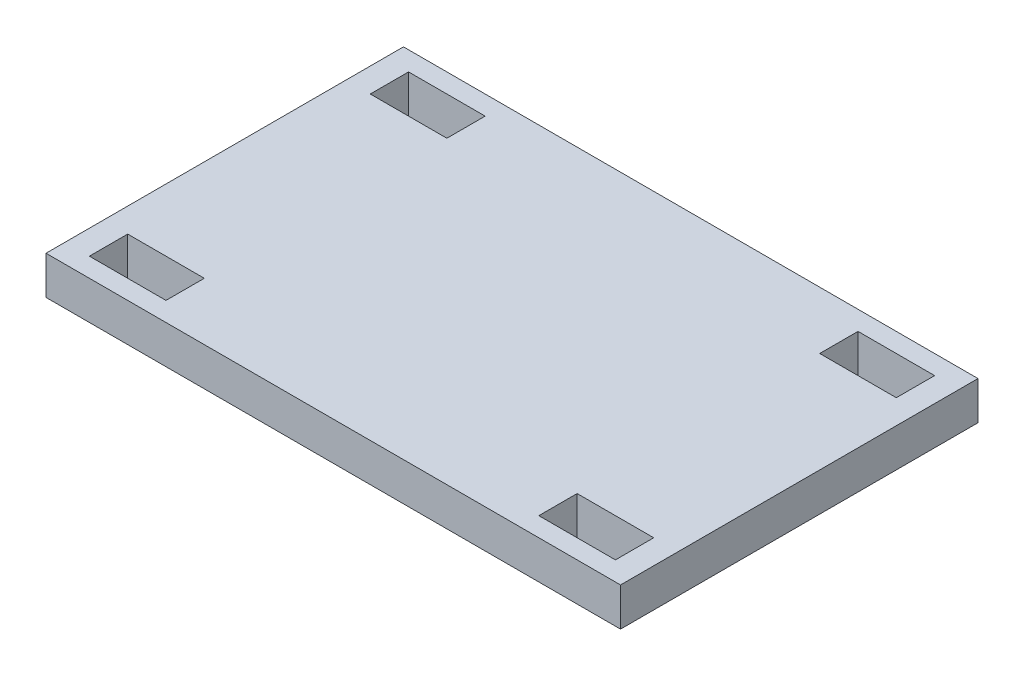
ISO-10303-21;
HEADER;
FILE_DESCRIPTION(('STEP AP214'),'2;1');
FILE_NAME('part.step','',(''),(''),'','','');
FILE_SCHEMA(('AUTOMOTIVE_DESIGN { 1 0 10303 214 1 1 1 1 }'));
ENDSEC;
DATA;
#1=APPLICATION_CONTEXT('core data for automotive mechanical design processes');
#2=APPLICATION_PROTOCOL_DEFINITION('international standard','automotive_design',2000,#1);
#3=PRODUCT_CONTEXT('',#1,'mechanical');
#4=PRODUCT('Part','Part','',(#3));
#5=PRODUCT_RELATED_PRODUCT_CATEGORY('part','',(#4));
#6=PRODUCT_DEFINITION_FORMATION('','',#4);
#7=PRODUCT_DEFINITION_CONTEXT('part definition',#1,'design');
#8=PRODUCT_DEFINITION('design','',#6,#7);
#9=PRODUCT_DEFINITION_SHAPE('','',#8);
#10=(LENGTH_UNIT() NAMED_UNIT(*) SI_UNIT(.MILLI.,.METRE.));
#11=(NAMED_UNIT(*) PLANE_ANGLE_UNIT() SI_UNIT($,.RADIAN.));
#12=(NAMED_UNIT(*) SI_UNIT($,.STERADIAN.) SOLID_ANGLE_UNIT());
#13=UNCERTAINTY_MEASURE_WITH_UNIT(LENGTH_MEASURE(1.E-05),#10,'distance_accuracy_value','');
#14=(GEOMETRIC_REPRESENTATION_CONTEXT(3) GLOBAL_UNCERTAINTY_ASSIGNED_CONTEXT((#13)) GLOBAL_UNIT_ASSIGNED_CONTEXT((#10,
#11,#12)) REPRESENTATION_CONTEXT('',''));
#15=CARTESIAN_POINT('',(0.,0.,0.));
#16=DIRECTION('',(0.,0.,1.));
#17=DIRECTION('',(1.,0.,0.));
#18=AXIS2_PLACEMENT_3D('',#15,#16,#17);
#19=CARTESIAN_POINT('',(0.,3.,0.));
#20=DIRECTION('',(1.,0.,0.));
#21=DIRECTION('',(0.,0.,-1.));
#22=AXIS2_PLACEMENT_3D('',#19,#20,#21);
#23=PLANE('',#22);
#24=DIRECTION('',(0.,0.,1.));
#25=VECTOR('',#24,1.);
#26=CARTESIAN_POINT('',(0.,0.,0.));
#27=LINE('',#26,#25);
#28=CARTESIAN_POINT('',(0.,0.,-28.));
#29=VERTEX_POINT('',#28);
#30=CARTESIAN_POINT('',(0.,0.,0.));
#31=VERTEX_POINT('',#30);
#32=EDGE_CURVE('E298',#29,#31,#27,.T.);
#33=ORIENTED_EDGE('',*,*,#32,.T.);
#34=DIRECTION('',(0.,-1.,0.));
#35=VECTOR('',#34,1.);
#36=CARTESIAN_POINT('',(0.,3.,0.));
#37=LINE('',#36,#35);
#38=CARTESIAN_POINT('',(0.,3.,0.));
#39=VERTEX_POINT('',#38);
#40=EDGE_CURVE('E11',#39,#31,#37,.T.);
#41=ORIENTED_EDGE('',*,*,#40,.F.);
#42=DIRECTION('',(0.,0.,1.));
#43=VECTOR('',#42,1.);
#44=CARTESIAN_POINT('',(0.,3.,0.));
#45=LINE('',#44,#43);
#46=CARTESIAN_POINT('',(0.,3.,-28.));
#47=VERTEX_POINT('',#46);
#48=EDGE_CURVE('E305',#47,#39,#45,.T.);
#49=ORIENTED_EDGE('',*,*,#48,.F.);
#50=DIRECTION('',(0.,-1.,0.));
#51=VECTOR('',#50,1.);
#52=CARTESIAN_POINT('',(0.,3.,-28.));
#53=LINE('',#52,#51);
#54=EDGE_CURVE('E315',#47,#29,#53,.T.);
#55=ORIENTED_EDGE('',*,*,#54,.T.);
#56=EDGE_LOOP('',(#33,#41,#49,#55));
#57=FACE_BOUND('',#56,.T.);
#58=ADVANCED_FACE('F33',(#57),#23,.F.);
#59=CARTESIAN_POINT('',(0.,3.,0.));
#60=DIRECTION('',(0.,0.,-1.));
#61=DIRECTION('',(-1.,0.,0.));
#62=AXIS2_PLACEMENT_3D('',#59,#60,#61);
#63=PLANE('',#62);
#64=DIRECTION('',(1.,0.,0.));
#65=VECTOR('',#64,1.);
#66=CARTESIAN_POINT('',(0.,0.,0.));
#67=LINE('',#66,#65);
#68=CARTESIAN_POINT('',(45.,0.,0.));
#69=VERTEX_POINT('',#68);
#70=EDGE_CURVE('E318',#31,#69,#67,.T.);
#71=ORIENTED_EDGE('',*,*,#70,.T.);
#72=DIRECTION('',(0.,-1.,0.));
#73=VECTOR('',#72,1.);
#74=CARTESIAN_POINT('',(45.,3.,0.));
#75=LINE('',#74,#73);
#76=CARTESIAN_POINT('',(45.,3.,0.));
#77=VERTEX_POINT('',#76);
#78=EDGE_CURVE('E40',#77,#69,#75,.T.);
#79=ORIENTED_EDGE('',*,*,#78,.F.);
#80=DIRECTION('',(1.,0.,0.));
#81=VECTOR('',#80,1.);
#82=CARTESIAN_POINT('',(0.,3.,0.));
#83=LINE('',#82,#81);
#84=EDGE_CURVE('E308',#39,#77,#83,.T.);
#85=ORIENTED_EDGE('',*,*,#84,.F.);
#86=ORIENTED_EDGE('',*,*,#40,.T.);
#87=EDGE_LOOP('',(#71,#79,#85,#86));
#88=FACE_BOUND('',#87,.T.);
#89=ADVANCED_FACE('F347',(#88),#63,.F.);
#90=CARTESIAN_POINT('',(45.,3.,0.));
#91=DIRECTION('',(-1.,0.,0.));
#92=DIRECTION('',(0.,0.,1.));
#93=AXIS2_PLACEMENT_3D('',#90,#91,#92);
#94=PLANE('',#93);
#95=DIRECTION('',(0.,0.,-1.));
#96=VECTOR('',#95,1.);
#97=CARTESIAN_POINT('',(45.,0.,0.));
#98=LINE('',#97,#96);
#99=CARTESIAN_POINT('',(45.,0.,-28.));
#100=VERTEX_POINT('',#99);
#101=EDGE_CURVE('E320',#69,#100,#98,.T.);
#102=ORIENTED_EDGE('',*,*,#101,.T.);
#103=DIRECTION('',(0.,-1.,0.));
#104=VECTOR('',#103,1.);
#105=CARTESIAN_POINT('',(45.,3.,-28.));
#106=LINE('',#105,#104);
#107=CARTESIAN_POINT('',(45.,3.,-28.));
#108=VERTEX_POINT('',#107);
#109=EDGE_CURVE('E325',#108,#100,#106,.T.);
#110=ORIENTED_EDGE('',*,*,#109,.F.);
#111=DIRECTION('',(0.,0.,-1.));
#112=VECTOR('',#111,1.);
#113=CARTESIAN_POINT('',(45.,3.,0.));
#114=LINE('',#113,#112);
#115=EDGE_CURVE('E311',#77,#108,#114,.T.);
#116=ORIENTED_EDGE('',*,*,#115,.F.);
#117=ORIENTED_EDGE('',*,*,#78,.T.);
#118=EDGE_LOOP('',(#102,#110,#116,#117));
#119=FACE_BOUND('',#118,.T.);
#120=ADVANCED_FACE('F332',(#119),#94,.F.);
#121=CARTESIAN_POINT('',(0.,3.,-28.));
#122=DIRECTION('',(0.,0.,1.));
#123=DIRECTION('',(1.,0.,0.));
#124=AXIS2_PLACEMENT_3D('',#121,#122,#123);
#125=PLANE('',#124);
#126=DIRECTION('',(-1.,0.,0.));
#127=VECTOR('',#126,1.);
#128=CARTESIAN_POINT('',(0.,0.,-28.));
#129=LINE('',#128,#127);
#130=EDGE_CURVE('E309',#100,#29,#129,.T.);
#131=ORIENTED_EDGE('',*,*,#130,.T.);
#132=ORIENTED_EDGE('',*,*,#54,.F.);
#133=DIRECTION('',(-1.,0.,0.));
#134=VECTOR('',#133,1.);
#135=CARTESIAN_POINT('',(0.,3.,-28.));
#136=LINE('',#135,#134);
#137=EDGE_CURVE('E313',#108,#47,#136,.T.);
#138=ORIENTED_EDGE('',*,*,#137,.F.);
#139=ORIENTED_EDGE('',*,*,#109,.T.);
#140=EDGE_LOOP('',(#131,#132,#138,#139));
#141=FACE_BOUND('',#140,.T.);
#142=ADVANCED_FACE('F340',(#141),#125,.F.);
#143=CARTESIAN_POINT('',(0.,3.,0.));
#144=DIRECTION('',(0.,-1.,0.));
#145=DIRECTION('',(0.,0.,-1.));
#146=AXIS2_PLACEMENT_3D('',#143,#144,#145);
#147=PLANE('',#146);
#148=DIRECTION('',(-1.,0.,0.));
#149=VECTOR('',#148,1.);
#150=CARTESIAN_POINT('',(43.1013959994442,3.,-26.5));
#151=LINE('',#150,#149);
#152=CARTESIAN_POINT('',(43.1013959994442,3.,-26.5));
#153=VERTEX_POINT('',#152);
#154=CARTESIAN_POINT('',(37.1013959994442,3.,-26.5));
#155=VERTEX_POINT('',#154);
#156=EDGE_CURVE('E259',#153,#155,#151,.T.);
#157=ORIENTED_EDGE('',*,*,#156,.F.);
#158=DIRECTION('',(0.,0.,-1.));
#159=VECTOR('',#158,1.);
#160=CARTESIAN_POINT('',(43.1013959994442,3.,-26.5));
#161=LINE('',#160,#159);
#162=CARTESIAN_POINT('',(43.1013959994442,3.,-23.5));
#163=VERTEX_POINT('',#162);
#164=EDGE_CURVE('E47',#163,#153,#161,.T.);
#165=ORIENTED_EDGE('',*,*,#164,.F.);
#166=DIRECTION('',(1.,0.,0.));
#167=VECTOR('',#166,1.);
#168=CARTESIAN_POINT('',(43.1013959994442,3.,-23.5));
#169=LINE('',#168,#167);
#170=CARTESIAN_POINT('',(37.1013959994442,3.,-23.5));
#171=VERTEX_POINT('',#170);
#172=EDGE_CURVE('E248',#171,#163,#169,.T.);
#173=ORIENTED_EDGE('',*,*,#172,.F.);
#174=DIRECTION('',(0.,0.,1.));
#175=VECTOR('',#174,1.);
#176=CARTESIAN_POINT('',(37.1013959994442,3.,-26.5));
#177=LINE('',#176,#175);
#178=EDGE_CURVE('E262',#155,#171,#177,.T.);
#179=ORIENTED_EDGE('',*,*,#178,.F.);
#180=EDGE_LOOP('',(#157,#165,#173,#179));
#181=FACE_BOUND('',#180,.T.);
#182=DIRECTION('',(0.,0.,-1.));
#183=VECTOR('',#182,1.);
#184=CARTESIAN_POINT('',(43.1013959994442,3.,-1.5));
#185=LINE('',#184,#183);
#186=CARTESIAN_POINT('',(43.1013959994442,3.,-1.5));
#187=VERTEX_POINT('',#186);
#188=CARTESIAN_POINT('',(43.1013959994442,3.,-4.5));
#189=VERTEX_POINT('',#188);
#190=EDGE_CURVE('E229',#187,#189,#185,.T.);
#191=ORIENTED_EDGE('',*,*,#190,.F.);
#192=DIRECTION('',(1.,0.,0.));
#193=VECTOR('',#192,1.);
#194=CARTESIAN_POINT('',(43.1013959994442,3.,-1.5));
#195=LINE('',#194,#193);
#196=CARTESIAN_POINT('',(37.1013959994442,3.,-1.5));
#197=VERTEX_POINT('',#196);
#198=EDGE_CURVE('E55',#197,#187,#195,.T.);
#199=ORIENTED_EDGE('',*,*,#198,.F.);
#200=DIRECTION('',(0.,0.,1.));
#201=VECTOR('',#200,1.);
#202=CARTESIAN_POINT('',(37.1013959994442,3.,-1.5));
#203=LINE('',#202,#201);
#204=CARTESIAN_POINT('',(37.1013959994442,3.,-4.5));
#205=VERTEX_POINT('',#204);
#206=EDGE_CURVE('E218',#205,#197,#203,.T.);
#207=ORIENTED_EDGE('',*,*,#206,.F.);
#208=DIRECTION('',(-1.,0.,0.));
#209=VECTOR('',#208,1.);
#210=CARTESIAN_POINT('',(43.1013959994442,3.,-4.5));
#211=LINE('',#210,#209);
#212=EDGE_CURVE('E233',#189,#205,#211,.T.);
#213=ORIENTED_EDGE('',*,*,#212,.F.);
#214=EDGE_LOOP('',(#191,#199,#207,#213));
#215=FACE_BOUND('',#214,.T.);
#216=DIRECTION('',(1.,0.,0.));
#217=VECTOR('',#216,1.);
#218=CARTESIAN_POINT('',(1.89860400055578,3.,-1.5));
#219=LINE('',#218,#217);
#220=CARTESIAN_POINT('',(1.89860400055578,3.,-1.5));
#221=VERTEX_POINT('',#220);
#222=CARTESIAN_POINT('',(7.89860400055578,3.,-1.5));
#223=VERTEX_POINT('',#222);
#224=EDGE_CURVE('E203',#221,#223,#219,.T.);
#225=ORIENTED_EDGE('',*,*,#224,.F.);
#226=DIRECTION('',(0.,0.,1.));
#227=VECTOR('',#226,1.);
#228=CARTESIAN_POINT('',(1.89860400055578,3.,-1.5));
#229=LINE('',#228,#227);
#230=CARTESIAN_POINT('',(1.89860400055578,3.,-4.5));
#231=VERTEX_POINT('',#230);
#232=EDGE_CURVE('E176',#231,#221,#229,.T.);
#233=ORIENTED_EDGE('',*,*,#232,.F.);
#234=DIRECTION('',(-1.,0.,0.));
#235=VECTOR('',#234,1.);
#236=CARTESIAN_POINT('',(1.89860400055578,3.,-4.5));
#237=LINE('',#236,#235);
#238=CARTESIAN_POINT('',(7.89860400055578,3.,-4.5));
#239=VERTEX_POINT('',#238);
#240=EDGE_CURVE('E194',#239,#231,#237,.T.);
#241=ORIENTED_EDGE('',*,*,#240,.F.);
#242=DIRECTION('',(0.,0.,-1.));
#243=VECTOR('',#242,1.);
#244=CARTESIAN_POINT('',(7.89860400055578,3.,-1.5));
#245=LINE('',#244,#243);
#246=EDGE_CURVE('E197',#223,#239,#245,.T.);
#247=ORIENTED_EDGE('',*,*,#246,.F.);
#248=EDGE_LOOP('',(#225,#233,#241,#247));
#249=FACE_BOUND('',#248,.T.);
#250=DIRECTION('',(1.,0.,0.));
#251=VECTOR('',#250,1.);
#252=CARTESIAN_POINT('',(1.89860400055578,3.,-23.5));
#253=LINE('',#252,#251);
#254=CARTESIAN_POINT('',(1.89860400055578,3.,-23.5));
#255=VERTEX_POINT('',#254);
#256=CARTESIAN_POINT('',(7.89860400055578,3.,-23.5));
#257=VERTEX_POINT('',#256);
#258=EDGE_CURVE('E288',#255,#257,#253,.T.);
#259=ORIENTED_EDGE('',*,*,#258,.F.);
#260=DIRECTION('',(0.,0.,1.));
#261=VECTOR('',#260,1.);
#262=CARTESIAN_POINT('',(1.89860400055578,3.,-26.5));
#263=LINE('',#262,#261);
#264=CARTESIAN_POINT('',(1.89860400055578,3.,-26.5));
#265=VERTEX_POINT('',#264);
#266=EDGE_CURVE('E210',#265,#255,#263,.T.);
#267=ORIENTED_EDGE('',*,*,#266,.F.);
#268=DIRECTION('',(-1.,0.,0.));
#269=VECTOR('',#268,1.);
#270=CARTESIAN_POINT('',(1.89860400055578,3.,-26.5));
#271=LINE('',#270,#269);
#272=CARTESIAN_POINT('',(7.89860400055578,3.,-26.5));
#273=VERTEX_POINT('',#272);
#274=EDGE_CURVE('E277',#273,#265,#271,.T.);
#275=ORIENTED_EDGE('',*,*,#274,.F.);
#276=DIRECTION('',(0.,0.,-1.));
#277=VECTOR('',#276,1.);
#278=CARTESIAN_POINT('',(7.89860400055578,3.,-26.5));
#279=LINE('',#278,#277);
#280=EDGE_CURVE('E291',#257,#273,#279,.T.);
#281=ORIENTED_EDGE('',*,*,#280,.F.);
#282=EDGE_LOOP('',(#259,#267,#275,#281));
#283=FACE_BOUND('',#282,.T.);
#284=ORIENTED_EDGE('',*,*,#48,.T.);
#285=ORIENTED_EDGE('',*,*,#84,.T.);
#286=ORIENTED_EDGE('',*,*,#115,.T.);
#287=ORIENTED_EDGE('',*,*,#137,.T.);
#288=EDGE_LOOP('',(#284,#285,#286,#287));
#289=FACE_BOUND('',#288,.T.);
#290=ADVANCED_FACE('F346',(#181,#215,#249,#283,#289),#147,.F.);
#291=CARTESIAN_POINT('',(0.,0.,0.));
#292=DIRECTION('',(0.,-1.,0.));
#293=DIRECTION('',(0.,0.,-1.));
#294=AXIS2_PLACEMENT_3D('',#291,#292,#293);
#295=PLANE('',#294);
#296=DIRECTION('',(0.,0.,-1.));
#297=VECTOR('',#296,1.);
#298=CARTESIAN_POINT('',(43.1013959994442,0.,-26.5));
#299=LINE('',#298,#297);
#300=CARTESIAN_POINT('',(43.1013959994442,0.,-23.5));
#301=VERTEX_POINT('',#300);
#302=CARTESIAN_POINT('',(43.1013959994442,0.,-26.5));
#303=VERTEX_POINT('',#302);
#304=EDGE_CURVE('E244',#301,#303,#299,.T.);
#305=ORIENTED_EDGE('',*,*,#304,.T.);
#306=DIRECTION('',(-1.,0.,0.));
#307=VECTOR('',#306,1.);
#308=CARTESIAN_POINT('',(43.1013959994442,0.,-26.5));
#309=LINE('',#308,#307);
#310=CARTESIAN_POINT('',(37.1013959994442,0.,-26.5));
#311=VERTEX_POINT('',#310);
#312=EDGE_CURVE('E247',#303,#311,#309,.T.);
#313=ORIENTED_EDGE('',*,*,#312,.T.);
#314=DIRECTION('',(0.,0.,1.));
#315=VECTOR('',#314,1.);
#316=CARTESIAN_POINT('',(37.1013959994442,0.,-26.5));
#317=LINE('',#316,#315);
#318=CARTESIAN_POINT('',(37.1013959994442,0.,-23.5));
#319=VERTEX_POINT('',#318);
#320=EDGE_CURVE('E251',#311,#319,#317,.T.);
#321=ORIENTED_EDGE('',*,*,#320,.T.);
#322=DIRECTION('',(1.,0.,0.));
#323=VECTOR('',#322,1.);
#324=CARTESIAN_POINT('',(43.1013959994442,0.,-23.5));
#325=LINE('',#324,#323);
#326=EDGE_CURVE('E254',#319,#301,#325,.T.);
#327=ORIENTED_EDGE('',*,*,#326,.T.);
#328=EDGE_LOOP('',(#305,#313,#321,#327));
#329=FACE_BOUND('',#328,.T.);
#330=DIRECTION('',(1.,0.,0.));
#331=VECTOR('',#330,1.);
#332=CARTESIAN_POINT('',(43.1013959994442,0.,-1.5));
#333=LINE('',#332,#331);
#334=CARTESIAN_POINT('',(37.1013959994442,0.,-1.5));
#335=VERTEX_POINT('',#334);
#336=CARTESIAN_POINT('',(43.1013959994442,0.,-1.5));
#337=VERTEX_POINT('',#336);
#338=EDGE_CURVE('E214',#335,#337,#333,.T.);
#339=ORIENTED_EDGE('',*,*,#338,.T.);
#340=DIRECTION('',(0.,0.,-1.));
#341=VECTOR('',#340,1.);
#342=CARTESIAN_POINT('',(43.1013959994442,0.,-1.5));
#343=LINE('',#342,#341);
#344=CARTESIAN_POINT('',(43.1013959994442,0.,-4.5));
#345=VERTEX_POINT('',#344);
#346=EDGE_CURVE('E217',#337,#345,#343,.T.);
#347=ORIENTED_EDGE('',*,*,#346,.T.);
#348=DIRECTION('',(-1.,0.,0.));
#349=VECTOR('',#348,1.);
#350=CARTESIAN_POINT('',(43.1013959994442,0.,-4.5));
#351=LINE('',#350,#349);
#352=CARTESIAN_POINT('',(37.1013959994442,0.,-4.5));
#353=VERTEX_POINT('',#352);
#354=EDGE_CURVE('E221',#345,#353,#351,.T.);
#355=ORIENTED_EDGE('',*,*,#354,.T.);
#356=DIRECTION('',(0.,0.,1.));
#357=VECTOR('',#356,1.);
#358=CARTESIAN_POINT('',(37.1013959994442,0.,-1.5));
#359=LINE('',#358,#357);
#360=EDGE_CURVE('E224',#353,#335,#359,.T.);
#361=ORIENTED_EDGE('',*,*,#360,.T.);
#362=EDGE_LOOP('',(#339,#347,#355,#361));
#363=FACE_BOUND('',#362,.T.);
#364=DIRECTION('',(0.,0.,1.));
#365=VECTOR('',#364,1.);
#366=CARTESIAN_POINT('',(1.89860400055578,0.,-1.5));
#367=LINE('',#366,#365);
#368=CARTESIAN_POINT('',(1.89860400055578,0.,-4.5));
#369=VERTEX_POINT('',#368);
#370=CARTESIAN_POINT('',(1.89860400055578,0.,-1.5));
#371=VERTEX_POINT('',#370);
#372=EDGE_CURVE('E173',#369,#371,#367,.T.);
#373=ORIENTED_EDGE('',*,*,#372,.T.);
#374=DIRECTION('',(1.,0.,0.));
#375=VECTOR('',#374,1.);
#376=CARTESIAN_POINT('',(1.89860400055578,0.,-1.5));
#377=LINE('',#376,#375);
#378=CARTESIAN_POINT('',(7.89860400055578,0.,-1.5));
#379=VERTEX_POINT('',#378);
#380=EDGE_CURVE('E185',#371,#379,#377,.T.);
#381=ORIENTED_EDGE('',*,*,#380,.T.);
#382=DIRECTION('',(0.,0.,-1.));
#383=VECTOR('',#382,1.);
#384=CARTESIAN_POINT('',(7.89860400055578,0.,-1.5));
#385=LINE('',#384,#383);
#386=CARTESIAN_POINT('',(7.89860400055578,0.,-4.5));
#387=VERTEX_POINT('',#386);
#388=EDGE_CURVE('E189',#379,#387,#385,.T.);
#389=ORIENTED_EDGE('',*,*,#388,.T.);
#390=DIRECTION('',(-1.,0.,0.));
#391=VECTOR('',#390,1.);
#392=CARTESIAN_POINT('',(1.89860400055578,0.,-4.5));
#393=LINE('',#392,#391);
#394=EDGE_CURVE('E181',#387,#369,#393,.T.);
#395=ORIENTED_EDGE('',*,*,#394,.T.);
#396=EDGE_LOOP('',(#373,#381,#389,#395));
#397=FACE_BOUND('',#396,.T.);
#398=DIRECTION('',(0.,0.,1.));
#399=VECTOR('',#398,1.);
#400=CARTESIAN_POINT('',(1.89860400055578,0.,-26.5));
#401=LINE('',#400,#399);
#402=CARTESIAN_POINT('',(1.89860400055578,0.,-26.5));
#403=VERTEX_POINT('',#402);
#404=CARTESIAN_POINT('',(1.89860400055578,0.,-23.5));
#405=VERTEX_POINT('',#404);
#406=EDGE_CURVE('E273',#403,#405,#401,.T.);
#407=ORIENTED_EDGE('',*,*,#406,.T.);
#408=DIRECTION('',(1.,0.,0.));
#409=VECTOR('',#408,1.);
#410=CARTESIAN_POINT('',(1.89860400055578,0.,-23.5));
#411=LINE('',#410,#409);
#412=CARTESIAN_POINT('',(7.89860400055578,0.,-23.5));
#413=VERTEX_POINT('',#412);
#414=EDGE_CURVE('E276',#405,#413,#411,.T.);
#415=ORIENTED_EDGE('',*,*,#414,.T.);
#416=DIRECTION('',(0.,0.,-1.));
#417=VECTOR('',#416,1.);
#418=CARTESIAN_POINT('',(7.89860400055578,0.,-26.5));
#419=LINE('',#418,#417);
#420=CARTESIAN_POINT('',(7.89860400055578,0.,-26.5));
#421=VERTEX_POINT('',#420);
#422=EDGE_CURVE('E280',#413,#421,#419,.T.);
#423=ORIENTED_EDGE('',*,*,#422,.T.);
#424=DIRECTION('',(-1.,0.,0.));
#425=VECTOR('',#424,1.);
#426=CARTESIAN_POINT('',(1.89860400055578,0.,-26.5));
#427=LINE('',#426,#425);
#428=EDGE_CURVE('E283',#421,#403,#427,.T.);
#429=ORIENTED_EDGE('',*,*,#428,.T.);
#430=EDGE_LOOP('',(#407,#415,#423,#429));
#431=FACE_BOUND('',#430,.T.);
#432=ORIENTED_EDGE('',*,*,#32,.F.);
#433=ORIENTED_EDGE('',*,*,#130,.F.);
#434=ORIENTED_EDGE('',*,*,#101,.F.);
#435=ORIENTED_EDGE('',*,*,#70,.F.);
#436=EDGE_LOOP('',(#432,#433,#434,#435));
#437=FACE_BOUND('',#436,.T.);
#438=ADVANCED_FACE('F191',(#329,#363,#397,#431,#437),#295,.T.);
#439=CARTESIAN_POINT('',(1.89860400055578,0.,-26.5));
#440=DIRECTION('',(-1.,0.,0.));
#441=DIRECTION('',(0.,0.,1.));
#442=AXIS2_PLACEMENT_3D('',#439,#440,#441);
#443=PLANE('',#442);
#444=ORIENTED_EDGE('',*,*,#266,.T.);
#445=DIRECTION('',(0.,1.,0.));
#446=VECTOR('',#445,1.);
#447=CARTESIAN_POINT('',(1.89860400055578,0.,-23.5));
#448=LINE('',#447,#446);
#449=EDGE_CURVE('E286',#405,#255,#448,.T.);
#450=ORIENTED_EDGE('',*,*,#449,.F.);
#451=ORIENTED_EDGE('',*,*,#406,.F.);
#452=DIRECTION('',(0.,1.,0.));
#453=VECTOR('',#452,1.);
#454=CARTESIAN_POINT('',(1.89860400055578,0.,-26.5));
#455=LINE('',#454,#453);
#456=EDGE_CURVE('E296',#403,#265,#455,.T.);
#457=ORIENTED_EDGE('',*,*,#456,.T.);
#458=EDGE_LOOP('',(#444,#450,#451,#457));
#459=FACE_BOUND('',#458,.T.);
#460=ADVANCED_FACE('F359',(#459),#443,.F.);
#461=CARTESIAN_POINT('',(1.89860400055578,0.,-26.5));
#462=DIRECTION('',(0.,0.,-1.));
#463=DIRECTION('',(-1.,0.,0.));
#464=AXIS2_PLACEMENT_3D('',#461,#462,#463);
#465=PLANE('',#464);
#466=ORIENTED_EDGE('',*,*,#274,.T.);
#467=ORIENTED_EDGE('',*,*,#456,.F.);
#468=ORIENTED_EDGE('',*,*,#428,.F.);
#469=DIRECTION('',(0.,1.,0.));
#470=VECTOR('',#469,1.);
#471=CARTESIAN_POINT('',(7.89860400055578,0.,-26.5));
#472=LINE('',#471,#470);
#473=EDGE_CURVE('E299',#421,#273,#472,.T.);
#474=ORIENTED_EDGE('',*,*,#473,.T.);
#475=EDGE_LOOP('',(#466,#467,#468,#474));
#476=FACE_BOUND('',#475,.T.);
#477=ADVANCED_FACE('F366',(#476),#465,.F.);
#478=CARTESIAN_POINT('',(7.89860400055578,0.,-26.5));
#479=DIRECTION('',(1.,0.,0.));
#480=DIRECTION('',(0.,0.,-1.));
#481=AXIS2_PLACEMENT_3D('',#478,#479,#480);
#482=PLANE('',#481);
#483=ORIENTED_EDGE('',*,*,#280,.T.);
#484=ORIENTED_EDGE('',*,*,#473,.F.);
#485=ORIENTED_EDGE('',*,*,#422,.F.);
#486=DIRECTION('',(0.,1.,0.));
#487=VECTOR('',#486,1.);
#488=CARTESIAN_POINT('',(7.89860400055578,0.,-23.5));
#489=LINE('',#488,#487);
#490=EDGE_CURVE('E301',#413,#257,#489,.T.);
#491=ORIENTED_EDGE('',*,*,#490,.T.);
#492=EDGE_LOOP('',(#483,#484,#485,#491));
#493=FACE_BOUND('',#492,.T.);
#494=ADVANCED_FACE('F371',(#493),#482,.F.);
#495=CARTESIAN_POINT('',(1.89860400055578,0.,-23.5));
#496=DIRECTION('',(0.,0.,1.));
#497=DIRECTION('',(1.,0.,0.));
#498=AXIS2_PLACEMENT_3D('',#495,#496,#497);
#499=PLANE('',#498);
#500=ORIENTED_EDGE('',*,*,#258,.T.);
#501=ORIENTED_EDGE('',*,*,#490,.F.);
#502=ORIENTED_EDGE('',*,*,#414,.F.);
#503=ORIENTED_EDGE('',*,*,#449,.T.);
#504=EDGE_LOOP('',(#500,#501,#502,#503));
#505=FACE_BOUND('',#504,.T.);
#506=ADVANCED_FACE('F368',(#505),#499,.F.);
#507=CARTESIAN_POINT('',(1.89860400055578,0.,-1.5));
#508=DIRECTION('',(-1.,0.,0.));
#509=DIRECTION('',(0.,0.,1.));
#510=AXIS2_PLACEMENT_3D('',#507,#508,#509);
#511=PLANE('',#510);
#512=ORIENTED_EDGE('',*,*,#232,.T.);
#513=DIRECTION('',(0.,1.,0.));
#514=VECTOR('',#513,1.);
#515=CARTESIAN_POINT('',(1.89860400055578,0.,-1.5));
#516=LINE('',#515,#514);
#517=EDGE_CURVE('E169',#371,#221,#516,.T.);
#518=ORIENTED_EDGE('',*,*,#517,.F.);
#519=ORIENTED_EDGE('',*,*,#372,.F.);
#520=DIRECTION('',(0.,1.,0.));
#521=VECTOR('',#520,1.);
#522=CARTESIAN_POINT('',(1.89860400055578,0.,-4.5));
#523=LINE('',#522,#521);
#524=EDGE_CURVE('E208',#369,#231,#523,.T.);
#525=ORIENTED_EDGE('',*,*,#524,.T.);
#526=EDGE_LOOP('',(#512,#518,#519,#525));
#527=FACE_BOUND('',#526,.T.);
#528=ADVANCED_FACE('F171',(#527),#511,.F.);
#529=CARTESIAN_POINT('',(1.89860400055578,0.,-4.5));
#530=DIRECTION('',(0.,0.,-1.));
#531=DIRECTION('',(-1.,0.,0.));
#532=AXIS2_PLACEMENT_3D('',#529,#530,#531);
#533=PLANE('',#532);
#534=ORIENTED_EDGE('',*,*,#240,.T.);
#535=ORIENTED_EDGE('',*,*,#524,.F.);
#536=ORIENTED_EDGE('',*,*,#394,.F.);
#537=DIRECTION('',(0.,1.,0.));
#538=VECTOR('',#537,1.);
#539=CARTESIAN_POINT('',(7.89860400055578,0.,-4.5));
#540=LINE('',#539,#538);
#541=EDGE_CURVE('E211',#387,#239,#540,.T.);
#542=ORIENTED_EDGE('',*,*,#541,.T.);
#543=EDGE_LOOP('',(#534,#535,#536,#542));
#544=FACE_BOUND('',#543,.T.);
#545=ADVANCED_FACE('F411',(#544),#533,.F.);
#546=CARTESIAN_POINT('',(7.89860400055578,0.,-1.5));
#547=DIRECTION('',(1.,0.,0.));
#548=DIRECTION('',(0.,0.,-1.));
#549=AXIS2_PLACEMENT_3D('',#546,#547,#548);
#550=PLANE('',#549);
#551=ORIENTED_EDGE('',*,*,#246,.T.);
#552=ORIENTED_EDGE('',*,*,#541,.F.);
#553=ORIENTED_EDGE('',*,*,#388,.F.);
#554=DIRECTION('',(0.,1.,0.));
#555=VECTOR('',#554,1.);
#556=CARTESIAN_POINT('',(7.89860400055578,0.,-1.5));
#557=LINE('',#556,#555);
#558=EDGE_CURVE('E180',#379,#223,#557,.T.);
#559=ORIENTED_EDGE('',*,*,#558,.T.);
#560=EDGE_LOOP('',(#551,#552,#553,#559));
#561=FACE_BOUND('',#560,.T.);
#562=ADVANCED_FACE('F414',(#561),#550,.F.);
#563=CARTESIAN_POINT('',(1.89860400055578,0.,-1.5));
#564=DIRECTION('',(0.,0.,1.));
#565=DIRECTION('',(1.,0.,0.));
#566=AXIS2_PLACEMENT_3D('',#563,#564,#565);
#567=PLANE('',#566);
#568=ORIENTED_EDGE('',*,*,#224,.T.);
#569=ORIENTED_EDGE('',*,*,#558,.F.);
#570=ORIENTED_EDGE('',*,*,#380,.F.);
#571=ORIENTED_EDGE('',*,*,#517,.T.);
#572=EDGE_LOOP('',(#568,#569,#570,#571));
#573=FACE_BOUND('',#572,.T.);
#574=ADVANCED_FACE('F186',(#573),#567,.F.);
#575=CARTESIAN_POINT('',(43.1013959994442,0.,-1.5));
#576=DIRECTION('',(0.,0.,1.));
#577=DIRECTION('',(1.,0.,0.));
#578=AXIS2_PLACEMENT_3D('',#575,#576,#577);
#579=PLANE('',#578);
#580=ORIENTED_EDGE('',*,*,#198,.T.);
#581=DIRECTION('',(0.,1.,0.));
#582=VECTOR('',#581,1.);
#583=CARTESIAN_POINT('',(43.1013959994442,0.,-1.5));
#584=LINE('',#583,#582);
#585=EDGE_CURVE('E227',#337,#187,#584,.T.);
#586=ORIENTED_EDGE('',*,*,#585,.F.);
#587=ORIENTED_EDGE('',*,*,#338,.F.);
#588=DIRECTION('',(0.,1.,0.));
#589=VECTOR('',#588,1.);
#590=CARTESIAN_POINT('',(37.1013959994442,0.,-1.5));
#591=LINE('',#590,#589);
#592=EDGE_CURVE('E204',#335,#197,#591,.T.);
#593=ORIENTED_EDGE('',*,*,#592,.T.);
#594=EDGE_LOOP('',(#580,#586,#587,#593));
#595=FACE_BOUND('',#594,.T.);
#596=ADVANCED_FACE('F395',(#595),#579,.F.);
#597=CARTESIAN_POINT('',(37.1013959994442,0.,-1.5));
#598=DIRECTION('',(-1.,0.,0.));
#599=DIRECTION('',(0.,0.,1.));
#600=AXIS2_PLACEMENT_3D('',#597,#598,#599);
#601=PLANE('',#600);
#602=ORIENTED_EDGE('',*,*,#206,.T.);
#603=ORIENTED_EDGE('',*,*,#592,.F.);
#604=ORIENTED_EDGE('',*,*,#360,.F.);
#605=DIRECTION('',(0.,1.,0.));
#606=VECTOR('',#605,1.);
#607=CARTESIAN_POINT('',(37.1013959994442,0.,-4.5));
#608=LINE('',#607,#606);
#609=EDGE_CURVE('E239',#353,#205,#608,.T.);
#610=ORIENTED_EDGE('',*,*,#609,.T.);
#611=EDGE_LOOP('',(#602,#603,#604,#610));
#612=FACE_BOUND('',#611,.T.);
#613=ADVANCED_FACE('F398',(#612),#601,.F.);
#614=CARTESIAN_POINT('',(43.1013959994442,0.,-4.5));
#615=DIRECTION('',(0.,0.,-1.));
#616=DIRECTION('',(-1.,0.,0.));
#617=AXIS2_PLACEMENT_3D('',#614,#615,#616);
#618=PLANE('',#617);
#619=ORIENTED_EDGE('',*,*,#212,.T.);
#620=ORIENTED_EDGE('',*,*,#609,.F.);
#621=ORIENTED_EDGE('',*,*,#354,.F.);
#622=DIRECTION('',(0.,1.,0.));
#623=VECTOR('',#622,1.);
#624=CARTESIAN_POINT('',(43.1013959994442,0.,-4.5));
#625=LINE('',#624,#623);
#626=EDGE_CURVE('E241',#345,#189,#625,.T.);
#627=ORIENTED_EDGE('',*,*,#626,.T.);
#628=EDGE_LOOP('',(#619,#620,#621,#627));
#629=FACE_BOUND('',#628,.T.);
#630=ADVANCED_FACE('F401',(#629),#618,.F.);
#631=CARTESIAN_POINT('',(43.1013959994442,0.,-1.5));
#632=DIRECTION('',(1.,0.,0.));
#633=DIRECTION('',(0.,0.,-1.));
#634=AXIS2_PLACEMENT_3D('',#631,#632,#633);
#635=PLANE('',#634);
#636=ORIENTED_EDGE('',*,*,#190,.T.);
#637=ORIENTED_EDGE('',*,*,#626,.F.);
#638=ORIENTED_EDGE('',*,*,#346,.F.);
#639=ORIENTED_EDGE('',*,*,#585,.T.);
#640=EDGE_LOOP('',(#636,#637,#638,#639));
#641=FACE_BOUND('',#640,.T.);
#642=ADVANCED_FACE('F383',(#641),#635,.F.);
#643=CARTESIAN_POINT('',(43.1013959994442,0.,-26.5));
#644=DIRECTION('',(1.,0.,0.));
#645=DIRECTION('',(0.,0.,-1.));
#646=AXIS2_PLACEMENT_3D('',#643,#644,#645);
#647=PLANE('',#646);
#648=ORIENTED_EDGE('',*,*,#164,.T.);
#649=DIRECTION('',(0.,1.,0.));
#650=VECTOR('',#649,1.);
#651=CARTESIAN_POINT('',(43.1013959994442,0.,-26.5));
#652=LINE('',#651,#650);
#653=EDGE_CURVE('E257',#303,#153,#652,.T.);
#654=ORIENTED_EDGE('',*,*,#653,.F.);
#655=ORIENTED_EDGE('',*,*,#304,.F.);
#656=DIRECTION('',(0.,1.,0.));
#657=VECTOR('',#656,1.);
#658=CARTESIAN_POINT('',(43.1013959994442,0.,-23.5));
#659=LINE('',#658,#657);
#660=EDGE_CURVE('E230',#301,#163,#659,.T.);
#661=ORIENTED_EDGE('',*,*,#660,.T.);
#662=EDGE_LOOP('',(#648,#654,#655,#661));
#663=FACE_BOUND('',#662,.T.);
#664=ADVANCED_FACE('F379',(#663),#647,.F.);
#665=CARTESIAN_POINT('',(43.1013959994442,0.,-23.5));
#666=DIRECTION('',(0.,0.,1.));
#667=DIRECTION('',(1.,0.,0.));
#668=AXIS2_PLACEMENT_3D('',#665,#666,#667);
#669=PLANE('',#668);
#670=ORIENTED_EDGE('',*,*,#172,.T.);
#671=ORIENTED_EDGE('',*,*,#660,.F.);
#672=ORIENTED_EDGE('',*,*,#326,.F.);
#673=DIRECTION('',(0.,1.,0.));
#674=VECTOR('',#673,1.);
#675=CARTESIAN_POINT('',(37.1013959994442,0.,-23.5));
#676=LINE('',#675,#674);
#677=EDGE_CURVE('E268',#319,#171,#676,.T.);
#678=ORIENTED_EDGE('',*,*,#677,.T.);
#679=EDGE_LOOP('',(#670,#671,#672,#678));
#680=FACE_BOUND('',#679,.T.);
#681=ADVANCED_FACE('F382',(#680),#669,.F.);
#682=CARTESIAN_POINT('',(37.1013959994442,0.,-26.5));
#683=DIRECTION('',(-1.,0.,0.));
#684=DIRECTION('',(0.,0.,1.));
#685=AXIS2_PLACEMENT_3D('',#682,#683,#684);
#686=PLANE('',#685);
#687=ORIENTED_EDGE('',*,*,#178,.T.);
#688=ORIENTED_EDGE('',*,*,#677,.F.);
#689=ORIENTED_EDGE('',*,*,#320,.F.);
#690=DIRECTION('',(0.,1.,0.));
#691=VECTOR('',#690,1.);
#692=CARTESIAN_POINT('',(37.1013959994442,0.,-26.5));
#693=LINE('',#692,#691);
#694=EDGE_CURVE('E270',#311,#155,#693,.T.);
#695=ORIENTED_EDGE('',*,*,#694,.T.);
#696=EDGE_LOOP('',(#687,#688,#689,#695));
#697=FACE_BOUND('',#696,.T.);
#698=ADVANCED_FACE('F387',(#697),#686,.F.);
#699=CARTESIAN_POINT('',(43.1013959994442,0.,-26.5));
#700=DIRECTION('',(0.,0.,-1.));
#701=DIRECTION('',(-1.,0.,0.));
#702=AXIS2_PLACEMENT_3D('',#699,#700,#701);
#703=PLANE('',#702);
#704=ORIENTED_EDGE('',*,*,#156,.T.);
#705=ORIENTED_EDGE('',*,*,#694,.F.);
#706=ORIENTED_EDGE('',*,*,#312,.F.);
#707=ORIENTED_EDGE('',*,*,#653,.T.);
#708=EDGE_LOOP('',(#704,#705,#706,#707));
#709=FACE_BOUND('',#708,.T.);
#710=ADVANCED_FACE('F384',(#709),#703,.F.);
#711=CLOSED_SHELL('',(#58,#89,#120,#142,#290,#438,#460,#477,#494,#506,#528,#545,#562,#574,#596,
#613,#630,#642,#664,#681,#698,#710));
#712=MANIFOLD_SOLID_BREP('B2',#711);
#713=ADVANCED_BREP_SHAPE_REPRESENTATION('',(#18,#712),#14);
#714=SHAPE_DEFINITION_REPRESENTATION(#9,#713);
ENDSEC;
END-ISO-10303-21;
